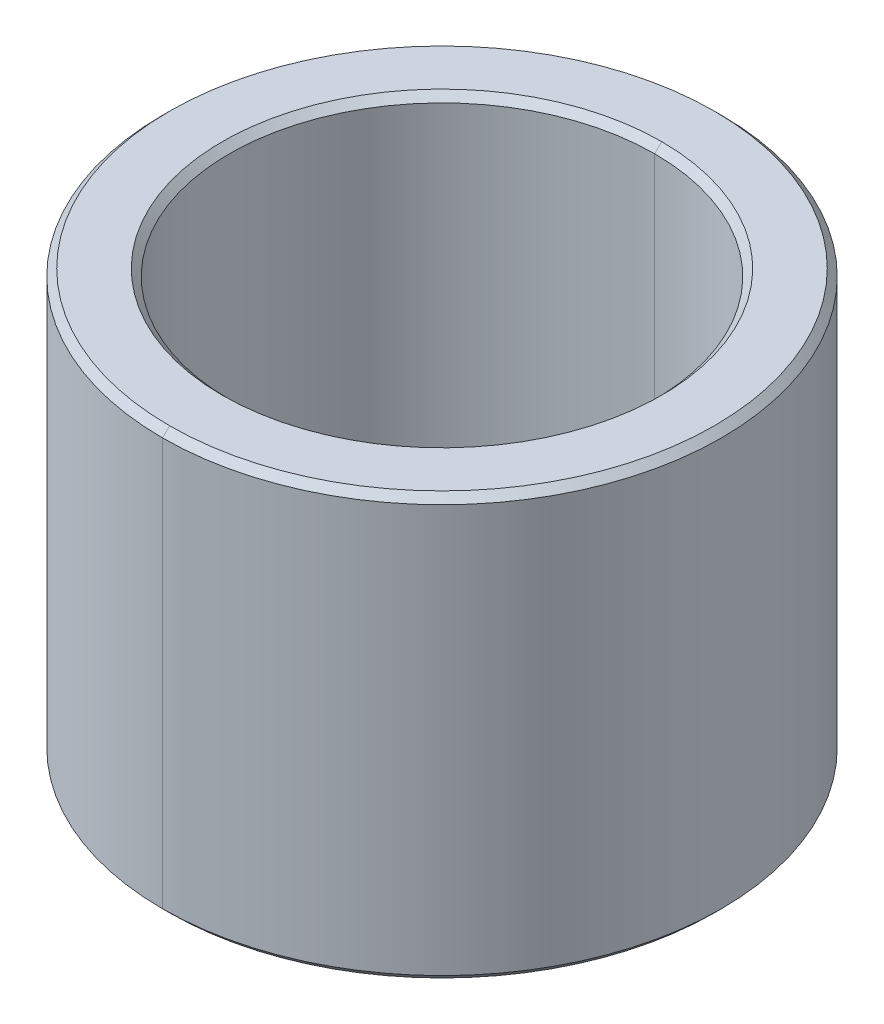
ISO-10303-21;
HEADER;
FILE_DESCRIPTION(('STEP AP214'),'2;1');
FILE_NAME('part.step','',(''),(''),'','','');
FILE_SCHEMA(('AUTOMOTIVE_DESIGN { 1 0 10303 214 1 1 1 1 }'));
ENDSEC;
DATA;
#1=APPLICATION_CONTEXT('core data for automotive mechanical design processes');
#2=APPLICATION_PROTOCOL_DEFINITION('international standard','automotive_design',2000,#1);
#3=PRODUCT_CONTEXT('',#1,'mechanical');
#4=PRODUCT('Part','Part','',(#3));
#5=PRODUCT_RELATED_PRODUCT_CATEGORY('part','',(#4));
#6=PRODUCT_DEFINITION_FORMATION('','',#4);
#7=PRODUCT_DEFINITION_CONTEXT('part definition',#1,'design');
#8=PRODUCT_DEFINITION('design','',#6,#7);
#9=PRODUCT_DEFINITION_SHAPE('','',#8);
#10=(LENGTH_UNIT() NAMED_UNIT(*) SI_UNIT(.MILLI.,.METRE.));
#11=(NAMED_UNIT(*) PLANE_ANGLE_UNIT() SI_UNIT($,.RADIAN.));
#12=(NAMED_UNIT(*) SI_UNIT($,.STERADIAN.) SOLID_ANGLE_UNIT());
#13=UNCERTAINTY_MEASURE_WITH_UNIT(LENGTH_MEASURE(1.E-05),#10,'distance_accuracy_value','');
#14=(GEOMETRIC_REPRESENTATION_CONTEXT(3) GLOBAL_UNCERTAINTY_ASSIGNED_CONTEXT((#13)) GLOBAL_UNIT_ASSIGNED_CONTEXT((#10,
#11,#12)) REPRESENTATION_CONTEXT('',''));
#15=CARTESIAN_POINT('',(0.,0.,0.));
#16=DIRECTION('',(0.,0.,1.));
#17=DIRECTION('',(1.,0.,0.));
#18=AXIS2_PLACEMENT_3D('',#15,#16,#17);
#19=CARTESIAN_POINT('',(0.,2.9,0.));
#20=DIRECTION('',(0.,1.,0.));
#21=DIRECTION('',(0.,0.,1.));
#22=AXIS2_PLACEMENT_3D('',#19,#20,#21);
#23=CONICAL_SURFACE('',#22,3.025,0.785398163397452);
#24=DIRECTION('',(0.,0.707106781186545,-0.707106781186551));
#25=VECTOR('',#24,1.);
#26=CARTESIAN_POINT('',(0.,2.9,-3.025));
#27=LINE('',#26,#25);
#28=CARTESIAN_POINT('',(0.,2.9,-3.025));
#29=VERTEX_POINT('',#28);
#30=CARTESIAN_POINT('',(0.,3.,-3.125));
#31=VERTEX_POINT('',#30);
#32=EDGE_CURVE('E166',#29,#31,#27,.T.);
#33=ORIENTED_EDGE('',*,*,#32,.F.);
#34=CARTESIAN_POINT('',(0.,2.9,0.));
#35=DIRECTION('',(0.,1.,0.));
#36=DIRECTION('',(0.,0.,1.));
#37=AXIS2_PLACEMENT_3D('',#34,#35,#36);
#38=CIRCLE('',#37,3.025);
#39=CARTESIAN_POINT('',(0.,2.9,3.025));
#40=VERTEX_POINT('',#39);
#41=EDGE_CURVE('E26',#40,#29,#38,.T.);
#42=ORIENTED_EDGE('',*,*,#41,.F.);
#43=DIRECTION('',(0.,0.707106781186545,0.707106781186551));
#44=VECTOR('',#43,1.);
#45=CARTESIAN_POINT('',(0.,2.9,3.025));
#46=LINE('',#45,#44);
#47=CARTESIAN_POINT('',(0.,3.,3.125));
#48=VERTEX_POINT('',#47);
#49=EDGE_CURVE('E142',#40,#48,#46,.T.);
#50=ORIENTED_EDGE('',*,*,#49,.T.);
#51=CARTESIAN_POINT('',(0.,3.,0.));
#52=DIRECTION('',(0.,-1.,0.));
#53=DIRECTION('',(0.,0.,1.));
#54=AXIS2_PLACEMENT_3D('',#51,#52,#53);
#55=CIRCLE('',#54,3.125);
#56=EDGE_CURVE('E145',#31,#48,#55,.T.);
#57=ORIENTED_EDGE('',*,*,#56,.F.);
#58=EDGE_LOOP('',(#33,#42,#50,#57));
#59=FACE_BOUND('',#58,.T.);
#60=ADVANCED_FACE('F15',(#59),#23,.F.);
#61=CARTESIAN_POINT('',(0.,-3.,0.));
#62=DIRECTION('',(0.,-1.,0.));
#63=DIRECTION('',(0.,0.,-1.));
#64=AXIS2_PLACEMENT_3D('',#61,#62,#63);
#65=CONICAL_SURFACE('',#64,3.125,0.785398163397448);
#66=DIRECTION('',(0.,-0.707106781186548,0.707106781186548));
#67=VECTOR('',#66,1.);
#68=CARTESIAN_POINT('',(0.,-3.,3.125));
#69=LINE('',#68,#67);
#70=CARTESIAN_POINT('',(0.,-2.9,3.025));
#71=VERTEX_POINT('',#70);
#72=CARTESIAN_POINT('',(0.,-3.,3.125));
#73=VERTEX_POINT('',#72);
#74=EDGE_CURVE('E131',#71,#73,#69,.T.);
#75=ORIENTED_EDGE('',*,*,#74,.F.);
#76=CARTESIAN_POINT('',(0.,-2.9,0.));
#77=DIRECTION('',(0.,-1.,0.));
#78=DIRECTION('',(0.,0.,1.));
#79=AXIS2_PLACEMENT_3D('',#76,#77,#78);
#80=CIRCLE('',#79,3.025);
#81=CARTESIAN_POINT('',(0.,-2.9,-3.025));
#82=VERTEX_POINT('',#81);
#83=EDGE_CURVE('E10',#82,#71,#80,.T.);
#84=ORIENTED_EDGE('',*,*,#83,.F.);
#85=DIRECTION('',(0.,-0.707106781186548,-0.707106781186548));
#86=VECTOR('',#85,1.);
#87=CARTESIAN_POINT('',(0.,-3.,-3.125));
#88=LINE('',#87,#86);
#89=CARTESIAN_POINT('',(0.,-3.,-3.125));
#90=VERTEX_POINT('',#89);
#91=EDGE_CURVE('E121',#82,#90,#88,.T.);
#92=ORIENTED_EDGE('',*,*,#91,.T.);
#93=CARTESIAN_POINT('',(0.,-3.,0.));
#94=DIRECTION('',(0.,1.,0.));
#95=DIRECTION('',(0.,0.,1.));
#96=AXIS2_PLACEMENT_3D('',#93,#94,#95);
#97=CIRCLE('',#96,3.125);
#98=EDGE_CURVE('E108',#73,#90,#97,.T.);
#99=ORIENTED_EDGE('',*,*,#98,.F.);
#100=EDGE_LOOP('',(#75,#84,#92,#99));
#101=FACE_BOUND('',#100,.T.);
#102=ADVANCED_FACE('F122',(#101),#65,.F.);
#103=CARTESIAN_POINT('',(0.,3.,0.));
#104=DIRECTION('',(0.,-1.,0.));
#105=DIRECTION('',(0.,0.,-1.));
#106=AXIS2_PLACEMENT_3D('',#103,#104,#105);
#107=CONICAL_SURFACE('',#106,3.875,0.785398163397448);
#108=DIRECTION('',(0.,-0.707106781186548,0.707106781186548));
#109=VECTOR('',#108,1.);
#110=CARTESIAN_POINT('',(0.,3.,3.875));
#111=LINE('',#110,#109);
#112=CARTESIAN_POINT('',(0.,3.,3.875));
#113=VERTEX_POINT('',#112);
#114=CARTESIAN_POINT('',(0.,2.9,3.975));
#115=VERTEX_POINT('',#114);
#116=EDGE_CURVE('E146',#113,#115,#111,.T.);
#117=ORIENTED_EDGE('',*,*,#116,.F.);
#118=CARTESIAN_POINT('',(0.,3.,0.));
#119=DIRECTION('',(0.,1.,0.));
#120=DIRECTION('',(0.,0.,1.));
#121=AXIS2_PLACEMENT_3D('',#118,#119,#120);
#122=CIRCLE('',#121,3.875);
#123=CARTESIAN_POINT('',(0.,3.,-3.875));
#124=VERTEX_POINT('',#123);
#125=EDGE_CURVE('E79',#124,#113,#122,.T.);
#126=ORIENTED_EDGE('',*,*,#125,.F.);
#127=DIRECTION('',(0.,-0.707106781186548,-0.707106781186548));
#128=VECTOR('',#127,1.);
#129=CARTESIAN_POINT('',(0.,3.,-3.875));
#130=LINE('',#129,#128);
#131=CARTESIAN_POINT('',(0.,2.9,-3.975));
#132=VERTEX_POINT('',#131);
#133=EDGE_CURVE('E154',#124,#132,#130,.T.);
#134=ORIENTED_EDGE('',*,*,#133,.T.);
#135=CARTESIAN_POINT('',(0.,2.9,0.));
#136=DIRECTION('',(0.,-1.,0.));
#137=DIRECTION('',(0.,0.,1.));
#138=AXIS2_PLACEMENT_3D('',#135,#136,#137);
#139=CIRCLE('',#138,3.975);
#140=EDGE_CURVE('E69',#115,#132,#139,.T.);
#141=ORIENTED_EDGE('',*,*,#140,.F.);
#142=EDGE_LOOP('',(#117,#126,#134,#141));
#143=FACE_BOUND('',#142,.T.);
#144=ADVANCED_FACE('F235',(#143),#107,.T.);
#145=CARTESIAN_POINT('',(0.,-2.9,0.));
#146=DIRECTION('',(0.,1.,0.));
#147=DIRECTION('',(0.,0.,1.));
#148=AXIS2_PLACEMENT_3D('',#145,#146,#147);
#149=CONICAL_SURFACE('',#148,3.975,0.785398163397457);
#150=DIRECTION('',(0.,0.707106781186542,-0.707106781186554));
#151=VECTOR('',#150,1.);
#152=CARTESIAN_POINT('',(0.,-2.9,-3.975));
#153=LINE('',#152,#151);
#154=CARTESIAN_POINT('',(0.,-3.,-3.875));
#155=VERTEX_POINT('',#154);
#156=CARTESIAN_POINT('',(0.,-2.9,-3.975));
#157=VERTEX_POINT('',#156);
#158=EDGE_CURVE('E176',#155,#157,#153,.T.);
#159=ORIENTED_EDGE('',*,*,#158,.F.);
#160=CARTESIAN_POINT('',(0.,-3.,0.));
#161=DIRECTION('',(0.,-1.,0.));
#162=DIRECTION('',(0.,0.,1.));
#163=AXIS2_PLACEMENT_3D('',#160,#161,#162);
#164=CIRCLE('',#163,3.875);
#165=CARTESIAN_POINT('',(0.,-3.,3.875));
#166=VERTEX_POINT('',#165);
#167=EDGE_CURVE('E118',#166,#155,#164,.T.);
#168=ORIENTED_EDGE('',*,*,#167,.F.);
#169=DIRECTION('',(0.,0.707106781186542,0.707106781186554));
#170=VECTOR('',#169,1.);
#171=CARTESIAN_POINT('',(0.,-2.9,3.975));
#172=LINE('',#171,#170);
#173=CARTESIAN_POINT('',(0.,-2.9,3.975));
#174=VERTEX_POINT('',#173);
#175=EDGE_CURVE('E184',#166,#174,#172,.T.);
#176=ORIENTED_EDGE('',*,*,#175,.T.);
#177=CARTESIAN_POINT('',(0.,-2.9,0.));
#178=DIRECTION('',(0.,1.,0.));
#179=DIRECTION('',(0.,0.,1.));
#180=AXIS2_PLACEMENT_3D('',#177,#178,#179);
#181=CIRCLE('',#180,3.975);
#182=EDGE_CURVE('E41',#157,#174,#181,.T.);
#183=ORIENTED_EDGE('',*,*,#182,.F.);
#184=EDGE_LOOP('',(#159,#168,#176,#183));
#185=FACE_BOUND('',#184,.T.);
#186=ADVANCED_FACE('F227',(#185),#149,.T.);
#187=CARTESIAN_POINT('',(0.,3.,0.));
#188=DIRECTION('',(0.,-1.,0.));
#189=DIRECTION('',(0.,0.,-1.));
#190=AXIS2_PLACEMENT_3D('',#187,#188,#189);
#191=CYLINDRICAL_SURFACE('',#190,3.025);
#192=DIRECTION('',(0.,-1.,0.));
#193=VECTOR('',#192,1.);
#194=CARTESIAN_POINT('',(0.,3.,3.025));
#195=LINE('',#194,#193);
#196=EDGE_CURVE('E161',#40,#71,#195,.T.);
#197=ORIENTED_EDGE('',*,*,#196,.F.);
#198=ORIENTED_EDGE('',*,*,#41,.T.);
#199=DIRECTION('',(0.,-1.,0.));
#200=VECTOR('',#199,1.);
#201=CARTESIAN_POINT('',(0.,3.,-3.025));
#202=LINE('',#201,#200);
#203=EDGE_CURVE('E158',#29,#82,#202,.T.);
#204=ORIENTED_EDGE('',*,*,#203,.T.);
#205=ORIENTED_EDGE('',*,*,#83,.T.);
#206=EDGE_LOOP('',(#197,#198,#204,#205));
#207=FACE_BOUND('',#206,.T.);
#208=ADVANCED_FACE('F224',(#207),#191,.F.);
#209=CARTESIAN_POINT('',(0.,3.,0.));
#210=DIRECTION('',(0.,-1.,0.));
#211=DIRECTION('',(0.,0.,-1.));
#212=AXIS2_PLACEMENT_3D('',#209,#210,#211);
#213=CYLINDRICAL_SURFACE('',#212,3.975);
#214=DIRECTION('',(0.,-1.,0.));
#215=VECTOR('',#214,1.);
#216=CARTESIAN_POINT('',(0.,3.,3.975));
#217=LINE('',#216,#215);
#218=EDGE_CURVE('E153',#115,#174,#217,.T.);
#219=ORIENTED_EDGE('',*,*,#218,.F.);
#220=ORIENTED_EDGE('',*,*,#140,.T.);
#221=DIRECTION('',(0.,-1.,0.));
#222=VECTOR('',#221,1.);
#223=CARTESIAN_POINT('',(0.,3.,-3.975));
#224=LINE('',#223,#222);
#225=EDGE_CURVE('E150',#132,#157,#224,.T.);
#226=ORIENTED_EDGE('',*,*,#225,.T.);
#227=ORIENTED_EDGE('',*,*,#182,.T.);
#228=EDGE_LOOP('',(#219,#220,#226,#227));
#229=FACE_BOUND('',#228,.T.);
#230=ADVANCED_FACE('F226',(#229),#213,.T.);
#231=CARTESIAN_POINT('',(0.,-3.,0.));
#232=DIRECTION('',(0.,1.,0.));
#233=DIRECTION('',(1.,0.,0.));
#234=AXIS2_PLACEMENT_3D('',#231,#232,#233);
#235=PLANE('',#234);
#236=CARTESIAN_POINT('',(0.,-3.,0.));
#237=DIRECTION('',(0.,1.,0.));
#238=DIRECTION('',(0.,0.,1.));
#239=AXIS2_PLACEMENT_3D('',#236,#237,#238);
#240=CIRCLE('',#239,3.125);
#241=EDGE_CURVE('E113',#90,#73,#240,.T.);
#242=ORIENTED_EDGE('',*,*,#241,.T.);
#243=ORIENTED_EDGE('',*,*,#98,.T.);
#244=EDGE_LOOP('',(#242,#243));
#245=FACE_BOUND('',#244,.T.);
#246=ORIENTED_EDGE('',*,*,#167,.T.);
#247=CARTESIAN_POINT('',(0.,-3.,0.));
#248=DIRECTION('',(0.,-1.,0.));
#249=DIRECTION('',(0.,0.,1.));
#250=AXIS2_PLACEMENT_3D('',#247,#248,#249);
#251=CIRCLE('',#250,3.875);
#252=EDGE_CURVE('E157',#155,#166,#251,.T.);
#253=ORIENTED_EDGE('',*,*,#252,.T.);
#254=EDGE_LOOP('',(#246,#253));
#255=FACE_BOUND('',#254,.T.);
#256=ADVANCED_FACE('F110',(#245,#255),#235,.F.);
#257=CARTESIAN_POINT('',(0.,3.,0.));
#258=DIRECTION('',(0.,1.,0.));
#259=DIRECTION('',(1.,0.,0.));
#260=AXIS2_PLACEMENT_3D('',#257,#258,#259);
#261=PLANE('',#260);
#262=CARTESIAN_POINT('',(0.,3.,0.));
#263=DIRECTION('',(0.,-1.,0.));
#264=DIRECTION('',(0.,0.,1.));
#265=AXIS2_PLACEMENT_3D('',#262,#263,#264);
#266=CIRCLE('',#265,3.125);
#267=EDGE_CURVE('E170',#48,#31,#266,.T.);
#268=ORIENTED_EDGE('',*,*,#267,.T.);
#269=ORIENTED_EDGE('',*,*,#56,.T.);
#270=EDGE_LOOP('',(#268,#269));
#271=FACE_BOUND('',#270,.T.);
#272=ORIENTED_EDGE('',*,*,#125,.T.);
#273=CARTESIAN_POINT('',(0.,3.,0.));
#274=DIRECTION('',(0.,1.,0.));
#275=DIRECTION('',(0.,0.,1.));
#276=AXIS2_PLACEMENT_3D('',#273,#274,#275);
#277=CIRCLE('',#276,3.875);
#278=EDGE_CURVE('E128',#113,#124,#277,.T.);
#279=ORIENTED_EDGE('',*,*,#278,.T.);
#280=EDGE_LOOP('',(#272,#279));
#281=FACE_BOUND('',#280,.T.);
#282=ADVANCED_FACE('F17',(#271,#281),#261,.T.);
#283=CARTESIAN_POINT('',(0.,3.,0.));
#284=DIRECTION('',(0.,-1.,0.));
#285=DIRECTION('',(0.,0.,-1.));
#286=AXIS2_PLACEMENT_3D('',#283,#284,#285);
#287=CYLINDRICAL_SURFACE('',#286,3.975);
#288=CARTESIAN_POINT('',(0.,2.9,0.));
#289=DIRECTION('',(0.,-1.,0.));
#290=DIRECTION('',(0.,0.,1.));
#291=AXIS2_PLACEMENT_3D('',#288,#289,#290);
#292=CIRCLE('',#291,3.975);
#293=EDGE_CURVE('E19',#132,#115,#292,.T.);
#294=ORIENTED_EDGE('',*,*,#293,.T.);
#295=ORIENTED_EDGE('',*,*,#218,.T.);
#296=CARTESIAN_POINT('',(0.,-2.9,0.));
#297=DIRECTION('',(0.,1.,0.));
#298=DIRECTION('',(0.,0.,1.));
#299=AXIS2_PLACEMENT_3D('',#296,#297,#298);
#300=CIRCLE('',#299,3.975);
#301=EDGE_CURVE('E180',#174,#157,#300,.T.);
#302=ORIENTED_EDGE('',*,*,#301,.T.);
#303=ORIENTED_EDGE('',*,*,#225,.F.);
#304=EDGE_LOOP('',(#294,#295,#302,#303));
#305=FACE_BOUND('',#304,.T.);
#306=ADVANCED_FACE('F261',(#305),#287,.T.);
#307=CARTESIAN_POINT('',(0.,3.,0.));
#308=DIRECTION('',(0.,-1.,0.));
#309=DIRECTION('',(0.,0.,-1.));
#310=AXIS2_PLACEMENT_3D('',#307,#308,#309);
#311=CYLINDRICAL_SURFACE('',#310,3.025);
#312=CARTESIAN_POINT('',(0.,2.9,0.));
#313=DIRECTION('',(0.,1.,0.));
#314=DIRECTION('',(0.,0.,1.));
#315=AXIS2_PLACEMENT_3D('',#312,#313,#314);
#316=CIRCLE('',#315,3.025);
#317=EDGE_CURVE('E171',#29,#40,#316,.T.);
#318=ORIENTED_EDGE('',*,*,#317,.T.);
#319=ORIENTED_EDGE('',*,*,#196,.T.);
#320=CARTESIAN_POINT('',(0.,-2.9,0.));
#321=DIRECTION('',(0.,-1.,0.));
#322=DIRECTION('',(0.,0.,1.));
#323=AXIS2_PLACEMENT_3D('',#320,#321,#322);
#324=CIRCLE('',#323,3.025);
#325=EDGE_CURVE('E138',#71,#82,#324,.T.);
#326=ORIENTED_EDGE('',*,*,#325,.T.);
#327=ORIENTED_EDGE('',*,*,#203,.F.);
#328=EDGE_LOOP('',(#318,#319,#326,#327));
#329=FACE_BOUND('',#328,.T.);
#330=ADVANCED_FACE('F214',(#329),#311,.F.);
#331=CARTESIAN_POINT('',(0.,-2.9,0.));
#332=DIRECTION('',(0.,1.,0.));
#333=DIRECTION('',(0.,0.,1.));
#334=AXIS2_PLACEMENT_3D('',#331,#332,#333);
#335=CONICAL_SURFACE('',#334,3.975,0.785398163397457);
#336=ORIENTED_EDGE('',*,*,#252,.F.);
#337=ORIENTED_EDGE('',*,*,#158,.T.);
#338=ORIENTED_EDGE('',*,*,#301,.F.);
#339=ORIENTED_EDGE('',*,*,#175,.F.);
#340=EDGE_LOOP('',(#336,#337,#338,#339));
#341=FACE_BOUND('',#340,.T.);
#342=ADVANCED_FACE('F251',(#341),#335,.T.);
#343=CARTESIAN_POINT('',(0.,3.,0.));
#344=DIRECTION('',(0.,-1.,0.));
#345=DIRECTION('',(0.,0.,-1.));
#346=AXIS2_PLACEMENT_3D('',#343,#344,#345);
#347=CONICAL_SURFACE('',#346,3.875,0.785398163397448);
#348=ORIENTED_EDGE('',*,*,#278,.F.);
#349=ORIENTED_EDGE('',*,*,#116,.T.);
#350=ORIENTED_EDGE('',*,*,#293,.F.);
#351=ORIENTED_EDGE('',*,*,#133,.F.);
#352=EDGE_LOOP('',(#348,#349,#350,#351));
#353=FACE_BOUND('',#352,.T.);
#354=ADVANCED_FACE('F246',(#353),#347,.T.);
#355=CARTESIAN_POINT('',(0.,-3.,0.));
#356=DIRECTION('',(0.,-1.,0.));
#357=DIRECTION('',(0.,0.,-1.));
#358=AXIS2_PLACEMENT_3D('',#355,#356,#357);
#359=CONICAL_SURFACE('',#358,3.125,0.785398163397448);
#360=ORIENTED_EDGE('',*,*,#325,.F.);
#361=ORIENTED_EDGE('',*,*,#74,.T.);
#362=ORIENTED_EDGE('',*,*,#241,.F.);
#363=ORIENTED_EDGE('',*,*,#91,.F.);
#364=EDGE_LOOP('',(#360,#361,#362,#363));
#365=FACE_BOUND('',#364,.T.);
#366=ADVANCED_FACE('F130',(#365),#359,.F.);
#367=CARTESIAN_POINT('',(0.,2.9,0.));
#368=DIRECTION('',(0.,1.,0.));
#369=DIRECTION('',(0.,0.,1.));
#370=AXIS2_PLACEMENT_3D('',#367,#368,#369);
#371=CONICAL_SURFACE('',#370,3.025,0.785398163397452);
#372=ORIENTED_EDGE('',*,*,#317,.F.);
#373=ORIENTED_EDGE('',*,*,#32,.T.);
#374=ORIENTED_EDGE('',*,*,#267,.F.);
#375=ORIENTED_EDGE('',*,*,#49,.F.);
#376=EDGE_LOOP('',(#372,#373,#374,#375));
#377=FACE_BOUND('',#376,.T.);
#378=ADVANCED_FACE('F220',(#377),#371,.F.);
#379=CLOSED_SHELL('',(#60,#102,#144,#186,#208,#230,#256,#282,#306,#330,#342,#354,#366,#378));
#380=MANIFOLD_SOLID_BREP('B1',#379);
#381=ADVANCED_BREP_SHAPE_REPRESENTATION('',(#18,#380),#14);
#382=SHAPE_DEFINITION_REPRESENTATION(#9,#381);
ENDSEC;
END-ISO-10303-21;
